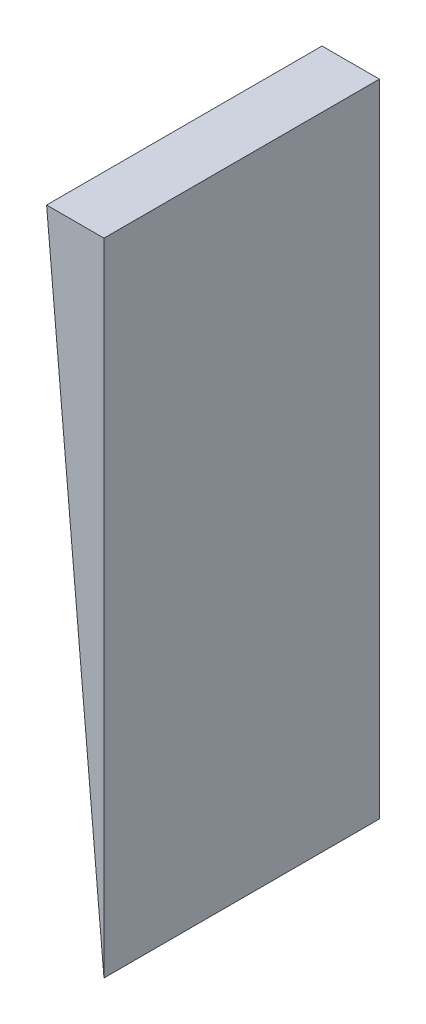
ISO-10303-21;
HEADER;
FILE_DESCRIPTION(('STEP AP214'),'2;1');
FILE_NAME('part.step','',(''),(''),'','','');
FILE_SCHEMA(('AUTOMOTIVE_DESIGN { 1 0 10303 214 1 1 1 1 }'));
ENDSEC;
DATA;
#1=APPLICATION_CONTEXT('core data for automotive mechanical design processes');
#2=APPLICATION_PROTOCOL_DEFINITION('international standard','automotive_design',2000,#1);
#3=PRODUCT_CONTEXT('',#1,'mechanical');
#4=PRODUCT('Part','Part','',(#3));
#5=PRODUCT_RELATED_PRODUCT_CATEGORY('part','',(#4));
#6=PRODUCT_DEFINITION_FORMATION('','',#4);
#7=PRODUCT_DEFINITION_CONTEXT('part definition',#1,'design');
#8=PRODUCT_DEFINITION('design','',#6,#7);
#9=PRODUCT_DEFINITION_SHAPE('','',#8);
#10=(LENGTH_UNIT() NAMED_UNIT(*) SI_UNIT(.MILLI.,.METRE.));
#11=(NAMED_UNIT(*) PLANE_ANGLE_UNIT() SI_UNIT($,.RADIAN.));
#12=(NAMED_UNIT(*) SI_UNIT($,.STERADIAN.) SOLID_ANGLE_UNIT());
#13=UNCERTAINTY_MEASURE_WITH_UNIT(LENGTH_MEASURE(1.E-05),#10,'distance_accuracy_value','');
#14=(GEOMETRIC_REPRESENTATION_CONTEXT(3) GLOBAL_UNCERTAINTY_ASSIGNED_CONTEXT((#13)) GLOBAL_UNIT_ASSIGNED_CONTEXT((#10,
#11,#12)) REPRESENTATION_CONTEXT('',''));
#15=CARTESIAN_POINT('',(0.,0.,0.));
#16=DIRECTION('',(0.,0.,1.));
#17=DIRECTION('',(1.,0.,0.));
#18=AXIS2_PLACEMENT_3D('',#15,#16,#17);
#19=CARTESIAN_POINT('',(0.,0.,72.));
#20=DIRECTION('',(0.,-1.,0.));
#21=DIRECTION('',(0.,0.,-1.));
#22=AXIS2_PLACEMENT_3D('',#19,#20,#21);
#23=PLANE('',#22);
#24=DIRECTION('',(-1.,0.,0.));
#25=VECTOR('',#24,1.);
#26=CARTESIAN_POINT('',(0.,0.,0.));
#27=LINE('',#26,#25);
#28=CARTESIAN_POINT('',(0.,0.,0.));
#29=VERTEX_POINT('',#28);
#30=CARTESIAN_POINT('',(-15.,0.,0.));
#31=VERTEX_POINT('',#30);
#32=EDGE_CURVE('E80',#29,#31,#27,.T.);
#33=ORIENTED_EDGE('',*,*,#32,.T.);
#34=DIRECTION('',(0.,0.,-1.));
#35=VECTOR('',#34,1.);
#36=CARTESIAN_POINT('',(-15.,0.,72.));
#37=LINE('',#36,#35);
#38=CARTESIAN_POINT('',(-15.,0.,72.));
#39=VERTEX_POINT('',#38);
#40=EDGE_CURVE('E11',#39,#31,#37,.T.);
#41=ORIENTED_EDGE('',*,*,#40,.F.);
#42=DIRECTION('',(-1.,0.,0.));
#43=VECTOR('',#42,1.);
#44=CARTESIAN_POINT('',(0.,0.,72.));
#45=LINE('',#44,#43);
#46=CARTESIAN_POINT('',(0.,0.,72.));
#47=VERTEX_POINT('',#46);
#48=EDGE_CURVE('E73',#47,#39,#45,.T.);
#49=ORIENTED_EDGE('',*,*,#48,.F.);
#50=DIRECTION('',(0.,0.,-1.));
#51=VECTOR('',#50,1.);
#52=CARTESIAN_POINT('',(0.,0.,72.));
#53=LINE('',#52,#51);
#54=EDGE_CURVE('E81',#47,#29,#53,.T.);
#55=ORIENTED_EDGE('',*,*,#54,.T.);
#56=EDGE_LOOP('',(#33,#41,#49,#55));
#57=FACE_BOUND('',#56,.T.);
#58=ADVANCED_FACE('F33',(#57),#23,.F.);
#59=CARTESIAN_POINT('',(-15.,0.,72.));
#60=DIRECTION('',(0.99601405790079,0.0891963926624926,0.));
#61=DIRECTION('',(-0.0891963926624926,0.99601405790079,0.));
#62=AXIS2_PLACEMENT_3D('',#59,#60,#61);
#63=PLANE('',#62);
#64=DIRECTION('',(0.0891963926624926,-0.99601405790079,0.));
#65=VECTOR('',#64,1.);
#66=CARTESIAN_POINT('',(-15.,0.,0.));
#67=LINE('',#66,#65);
#68=CARTESIAN_POINT('',(0.,-167.497927018682,0.));
#69=VERTEX_POINT('',#68);
#70=EDGE_CURVE('E61',#31,#69,#67,.T.);
#71=ORIENTED_EDGE('',*,*,#70,.T.);
#72=DIRECTION('',(0.,0.,-1.));
#73=VECTOR('',#72,1.);
#74=CARTESIAN_POINT('',(0.,-167.497927018682,72.));
#75=LINE('',#74,#73);
#76=CARTESIAN_POINT('',(0.,-167.497927018682,72.));
#77=VERTEX_POINT('',#76);
#78=EDGE_CURVE('E41',#77,#69,#75,.T.);
#79=ORIENTED_EDGE('',*,*,#78,.F.);
#80=DIRECTION('',(0.0891963926624926,-0.99601405790079,0.));
#81=VECTOR('',#80,1.);
#82=CARTESIAN_POINT('',(-15.,0.,72.));
#83=LINE('',#82,#81);
#84=EDGE_CURVE('E69',#39,#77,#83,.T.);
#85=ORIENTED_EDGE('',*,*,#84,.F.);
#86=ORIENTED_EDGE('',*,*,#40,.T.);
#87=EDGE_LOOP('',(#71,#79,#85,#86));
#88=FACE_BOUND('',#87,.T.);
#89=ADVANCED_FACE('F70',(#88),#63,.F.);
#90=CARTESIAN_POINT('',(0.,-167.497927018682,72.));
#91=DIRECTION('',(-1.,0.,0.));
#92=DIRECTION('',(0.,-1.,0.));
#93=AXIS2_PLACEMENT_3D('',#90,#91,#92);
#94=PLANE('',#93);
#95=DIRECTION('',(0.,1.,0.));
#96=VECTOR('',#95,1.);
#97=CARTESIAN_POINT('',(0.,-167.497927018682,0.));
#98=LINE('',#97,#96);
#99=EDGE_CURVE('E66',#69,#29,#98,.T.);
#100=ORIENTED_EDGE('',*,*,#99,.T.);
#101=ORIENTED_EDGE('',*,*,#54,.F.);
#102=DIRECTION('',(0.,1.,0.));
#103=VECTOR('',#102,1.);
#104=CARTESIAN_POINT('',(0.,-167.497927018682,72.));
#105=LINE('',#104,#103);
#106=EDGE_CURVE('E49',#77,#47,#105,.T.);
#107=ORIENTED_EDGE('',*,*,#106,.F.);
#108=ORIENTED_EDGE('',*,*,#78,.T.);
#109=EDGE_LOOP('',(#100,#101,#107,#108));
#110=FACE_BOUND('',#109,.T.);
#111=ADVANCED_FACE('F88',(#110),#94,.F.);
#112=CARTESIAN_POINT('',(0.,0.,72.));
#113=DIRECTION('',(0.,0.,-1.));
#114=DIRECTION('',(-1.,0.,0.));
#115=AXIS2_PLACEMENT_3D('',#112,#113,#114);
#116=PLANE('',#115);
#117=ORIENTED_EDGE('',*,*,#48,.T.);
#118=ORIENTED_EDGE('',*,*,#84,.T.);
#119=ORIENTED_EDGE('',*,*,#106,.T.);
#120=EDGE_LOOP('',(#117,#118,#119));
#121=FACE_BOUND('',#120,.T.);
#122=ADVANCED_FACE('F76',(#121),#116,.F.);
#123=CARTESIAN_POINT('',(0.,0.,0.));
#124=DIRECTION('',(0.,0.,-1.));
#125=DIRECTION('',(-1.,0.,0.));
#126=AXIS2_PLACEMENT_3D('',#123,#124,#125);
#127=PLANE('',#126);
#128=ORIENTED_EDGE('',*,*,#32,.F.);
#129=ORIENTED_EDGE('',*,*,#99,.F.);
#130=ORIENTED_EDGE('',*,*,#70,.F.);
#131=EDGE_LOOP('',(#128,#129,#130));
#132=FACE_BOUND('',#131,.T.);
#133=ADVANCED_FACE('F89',(#132),#127,.T.);
#134=CLOSED_SHELL('',(#58,#89,#111,#122,#133));
#135=MANIFOLD_SOLID_BREP('B2',#134);
#136=ADVANCED_BREP_SHAPE_REPRESENTATION('',(#18,#135),#14);
#137=SHAPE_DEFINITION_REPRESENTATION(#9,#136);
ENDSEC;
END-ISO-10303-21;
